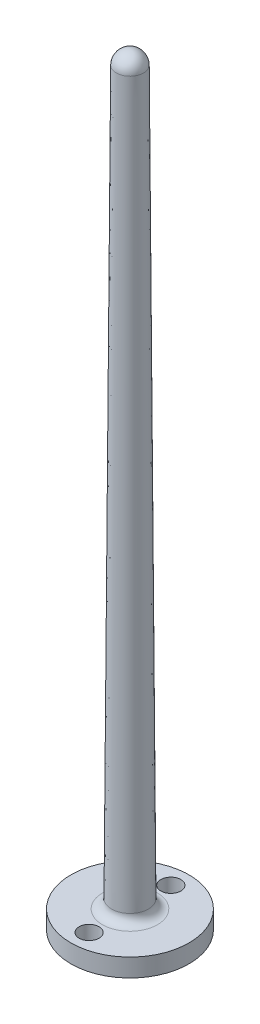
ISO-10303-21;
HEADER;
FILE_DESCRIPTION(('STEP AP214'),'2;1');
FILE_NAME('part.step','',(''),(''),'','','');
FILE_SCHEMA(('AUTOMOTIVE_DESIGN { 1 0 10303 214 1 1 1 1 }'));
ENDSEC;
DATA;
#1=APPLICATION_CONTEXT('core data for automotive mechanical design processes');
#2=APPLICATION_PROTOCOL_DEFINITION('international standard','automotive_design',2000,#1);
#3=PRODUCT_CONTEXT('',#1,'mechanical');
#4=PRODUCT('Part','Part','',(#3));
#5=PRODUCT_RELATED_PRODUCT_CATEGORY('part','',(#4));
#6=PRODUCT_DEFINITION_FORMATION('','',#4);
#7=PRODUCT_DEFINITION_CONTEXT('part definition',#1,'design');
#8=PRODUCT_DEFINITION('design','',#6,#7);
#9=PRODUCT_DEFINITION_SHAPE('','',#8);
#10=(LENGTH_UNIT() NAMED_UNIT(*) SI_UNIT(.MILLI.,.METRE.));
#11=(NAMED_UNIT(*) PLANE_ANGLE_UNIT() SI_UNIT($,.RADIAN.));
#12=(NAMED_UNIT(*) SI_UNIT($,.STERADIAN.) SOLID_ANGLE_UNIT());
#13=UNCERTAINTY_MEASURE_WITH_UNIT(LENGTH_MEASURE(1.E-05),#10,'distance_accuracy_value','');
#14=(GEOMETRIC_REPRESENTATION_CONTEXT(3) GLOBAL_UNCERTAINTY_ASSIGNED_CONTEXT((#13)) GLOBAL_UNIT_ASSIGNED_CONTEXT((#10,
#11,#12)) REPRESENTATION_CONTEXT('',''));
#15=CARTESIAN_POINT('',(0.,0.,0.));
#16=DIRECTION('',(0.,0.,1.));
#17=DIRECTION('',(1.,0.,0.));
#18=AXIS2_PLACEMENT_3D('',#15,#16,#17);
#19=CARTESIAN_POINT('',(0.,2.,0.));
#20=DIRECTION('',(0.,-1.,0.));
#21=DIRECTION('',(0.,0.,-1.));
#22=AXIS2_PLACEMENT_3D('',#19,#20,#21);
#23=CYLINDRICAL_SURFACE('',#22,6.5);
#24=CARTESIAN_POINT('',(0.,2.,0.));
#25=DIRECTION('',(0.,1.,0.));
#26=DIRECTION('',(0.,0.,1.));
#27=AXIS2_PLACEMENT_3D('',#24,#25,#26);
#28=CIRCLE('',#27,6.5);
#29=CARTESIAN_POINT('',(0.,2.,6.5));
#30=VERTEX_POINT('',#29);
#31=EDGE_CURVE('E39',#30,#30,#28,.T.);
#32=ORIENTED_EDGE('',*,*,#31,.F.);
#33=EDGE_LOOP('',(#32));
#34=FACE_BOUND('',#33,.T.);
#35=CARTESIAN_POINT('',(0.,0.,0.));
#36=DIRECTION('',(0.,1.,0.));
#37=DIRECTION('',(0.,0.,1.));
#38=AXIS2_PLACEMENT_3D('',#35,#36,#37);
#39=CIRCLE('',#38,6.5);
#40=CARTESIAN_POINT('',(0.,0.,6.5));
#41=VERTEX_POINT('',#40);
#42=EDGE_CURVE('E43',#41,#41,#39,.T.);
#43=ORIENTED_EDGE('',*,*,#42,.T.);
#44=EDGE_LOOP('',(#43));
#45=FACE_BOUND('',#44,.T.);
#46=ADVANCED_FACE('F33',(#34,#45),#23,.T.);
#47=CARTESIAN_POINT('',(0.,2.,0.));
#48=DIRECTION('',(0.,1.,0.));
#49=DIRECTION('',(0.,0.,1.));
#50=AXIS2_PLACEMENT_3D('',#47,#48,#49);
#51=PLANE('',#50);
#52=CARTESIAN_POINT('',(0.,2.,0.));
#53=DIRECTION('',(0.,-1.,0.));
#54=DIRECTION('',(0.,0.,-1.));
#55=AXIS2_PLACEMENT_3D('',#52,#53,#54);
#56=CIRCLE('',#55,3.02567528359711);
#57=CARTESIAN_POINT('',(0.,2.,-3.02567528359711));
#58=VERTEX_POINT('',#57);
#59=EDGE_CURVE('E10',#58,#58,#56,.F.);
#60=ORIENTED_EDGE('',*,*,#59,.F.);
#61=EDGE_LOOP('',(#60));
#62=FACE_BOUND('',#61,.T.);
#63=CARTESIAN_POINT('',(0.,2.,-4.5));
#64=DIRECTION('',(0.,1.,0.));
#65=DIRECTION('',(0.,0.,1.));
#66=AXIS2_PLACEMENT_3D('',#63,#64,#65);
#67=CIRCLE('',#66,1.1);
#68=CARTESIAN_POINT('',(0.,2.,-3.4));
#69=VERTEX_POINT('',#68);
#70=EDGE_CURVE('E57',#69,#69,#67,.T.);
#71=ORIENTED_EDGE('',*,*,#70,.F.);
#72=EDGE_LOOP('',(#71));
#73=FACE_BOUND('',#72,.T.);
#74=CARTESIAN_POINT('',(0.,2.,4.5));
#75=DIRECTION('',(0.,1.,0.));
#76=DIRECTION('',(0.,0.,-1.));
#77=AXIS2_PLACEMENT_3D('',#74,#75,#76);
#78=CIRCLE('',#77,1.1);
#79=CARTESIAN_POINT('',(0.,2.,3.4));
#80=VERTEX_POINT('',#79);
#81=EDGE_CURVE('E50',#80,#80,#78,.T.);
#82=ORIENTED_EDGE('',*,*,#81,.F.);
#83=EDGE_LOOP('',(#82));
#84=FACE_BOUND('',#83,.T.);
#85=ORIENTED_EDGE('',*,*,#31,.T.);
#86=EDGE_LOOP('',(#85));
#87=FACE_BOUND('',#86,.T.);
#88=ADVANCED_FACE('F84',(#62,#73,#84,#87),#51,.T.);
#89=CARTESIAN_POINT('',(0.,0.,0.));
#90=DIRECTION('',(0.,1.,0.));
#91=DIRECTION('',(0.,0.,1.));
#92=AXIS2_PLACEMENT_3D('',#89,#90,#91);
#93=PLANE('',#92);
#94=CARTESIAN_POINT('',(0.,0.,-4.5));
#95=DIRECTION('',(0.,1.,0.));
#96=DIRECTION('',(0.,0.,1.));
#97=AXIS2_PLACEMENT_3D('',#94,#95,#96);
#98=CIRCLE('',#97,1.1);
#99=CARTESIAN_POINT('',(0.,0.,-3.4));
#100=VERTEX_POINT('',#99);
#101=EDGE_CURVE('E48',#100,#100,#98,.T.);
#102=ORIENTED_EDGE('',*,*,#101,.T.);
#103=EDGE_LOOP('',(#102));
#104=FACE_BOUND('',#103,.T.);
#105=CARTESIAN_POINT('',(0.,0.,4.5));
#106=DIRECTION('',(0.,1.,0.));
#107=DIRECTION('',(0.,0.,-1.));
#108=AXIS2_PLACEMENT_3D('',#105,#106,#107);
#109=CIRCLE('',#108,1.1);
#110=CARTESIAN_POINT('',(0.,0.,3.4));
#111=VERTEX_POINT('',#110);
#112=EDGE_CURVE('E53',#111,#111,#109,.T.);
#113=ORIENTED_EDGE('',*,*,#112,.T.);
#114=EDGE_LOOP('',(#113));
#115=FACE_BOUND('',#114,.T.);
#116=ORIENTED_EDGE('',*,*,#42,.F.);
#117=EDGE_LOOP('',(#116));
#118=FACE_BOUND('',#117,.T.);
#119=ADVANCED_FACE('F89',(#104,#115,#118),#93,.F.);
#120=CARTESIAN_POINT('',(0.,0.,4.5));
#121=DIRECTION('',(0.,1.,0.));
#122=DIRECTION('',(0.,0.,1.));
#123=AXIS2_PLACEMENT_3D('',#120,#121,#122);
#124=CYLINDRICAL_SURFACE('',#123,1.1);
#125=ORIENTED_EDGE('',*,*,#112,.F.);
#126=EDGE_LOOP('',(#125));
#127=FACE_BOUND('',#126,.T.);
#128=ORIENTED_EDGE('',*,*,#81,.T.);
#129=EDGE_LOOP('',(#128));
#130=FACE_BOUND('',#129,.T.);
#131=ADVANCED_FACE('F96',(#127,#130),#124,.F.);
#132=CARTESIAN_POINT('',(0.,0.,-4.5));
#133=DIRECTION('',(0.,1.,0.));
#134=DIRECTION('',(0.,0.,1.));
#135=AXIS2_PLACEMENT_3D('',#132,#133,#134);
#136=CYLINDRICAL_SURFACE('',#135,1.1);
#137=ORIENTED_EDGE('',*,*,#101,.F.);
#138=EDGE_LOOP('',(#137));
#139=FACE_BOUND('',#138,.T.);
#140=ORIENTED_EDGE('',*,*,#70,.T.);
#141=EDGE_LOOP('',(#140));
#142=FACE_BOUND('',#141,.T.);
#143=ADVANCED_FACE('F80',(#139,#142),#136,.F.);
#144=CARTESIAN_POINT('',(0.,82.4353658868883,0.));
#145=DIRECTION('',(0.,-1.,0.));
#146=DIRECTION('',(1.,0.,0.));
#147=AXIS2_PLACEMENT_3D('',#144,#145,#146);
#148=SPHERICAL_SURFACE('',#147,1.50307531669588);
#149=CARTESIAN_POINT('',(0.,82.445253280311,0.));
#150=DIRECTION('',(0.,-1.,0.));
#151=DIRECTION('',(0.,0.,-1.));
#152=AXIS2_PLACEMENT_3D('',#149,#150,#151);
#153=CIRCLE('',#152,1.50304279616773);
#154=CARTESIAN_POINT('',(0.,82.445253280311,-1.50304279616773));
#155=VERTEX_POINT('',#154);
#156=EDGE_CURVE('E54',#155,#155,#153,.T.);
#157=ORIENTED_EDGE('',*,*,#156,.F.);
#158=EDGE_LOOP('',(#157));
#159=FACE_BOUND('',#158,.T.);
#160=ADVANCED_FACE('F72',(#159),#148,.T.);
#161=CARTESIAN_POINT('',(0.,2.99342189089738,0.));
#162=DIRECTION('',(0.,-1.,0.));
#163=DIRECTION('',(0.,0.,-1.));
#164=AXIS2_PLACEMENT_3D('',#161,#162,#163);
#165=CONICAL_SURFACE('',#164,2.02569691959146,0.00657815654433795);
#166=ORIENTED_EDGE('',*,*,#156,.T.);
#167=EDGE_LOOP('',(#166));
#168=FACE_BOUND('',#167,.T.);
#169=CARTESIAN_POINT('',(0.,2.99342189089738,0.));
#170=DIRECTION('',(0.,-1.,0.));
#171=DIRECTION('',(0.,0.,-1.));
#172=AXIS2_PLACEMENT_3D('',#169,#170,#171);
#173=CIRCLE('',#172,2.02569691959146);
#174=CARTESIAN_POINT('',(0.,2.99342189089738,-2.02569691959146));
#175=VERTEX_POINT('',#174);
#176=EDGE_CURVE('E64',#175,#175,#173,.T.);
#177=ORIENTED_EDGE('',*,*,#176,.F.);
#178=EDGE_LOOP('',(#177));
#179=FACE_BOUND('',#178,.T.);
#180=ADVANCED_FACE('F70',(#168,#179),#165,.T.);
#181=CARTESIAN_POINT('',(0.,3.,0.));
#182=DIRECTION('',(0.,-1.,0.));
#183=DIRECTION('',(0.,0.,-1.));
#184=AXIS2_PLACEMENT_3D('',#181,#182,#183);
#185=TOROIDAL_SURFACE('',#184,3.02567528359711,0.999999999999694);
#186=ORIENTED_EDGE('',*,*,#176,.T.);
#187=EDGE_LOOP('',(#186));
#188=FACE_BOUND('',#187,.T.);
#189=ORIENTED_EDGE('',*,*,#59,.T.);
#190=EDGE_LOOP('',(#189));
#191=FACE_BOUND('',#190,.T.);
#192=ADVANCED_FACE('F68',(#188,#191),#185,.F.);
#193=CLOSED_SHELL('',(#46,#88,#119,#131,#143,#160,#180,#192));
#194=MANIFOLD_SOLID_BREP('B2',#193);
#195=ADVANCED_BREP_SHAPE_REPRESENTATION('',(#18,#194),#14);
#196=SHAPE_DEFINITION_REPRESENTATION(#9,#195);
ENDSEC;
END-ISO-10303-21;
